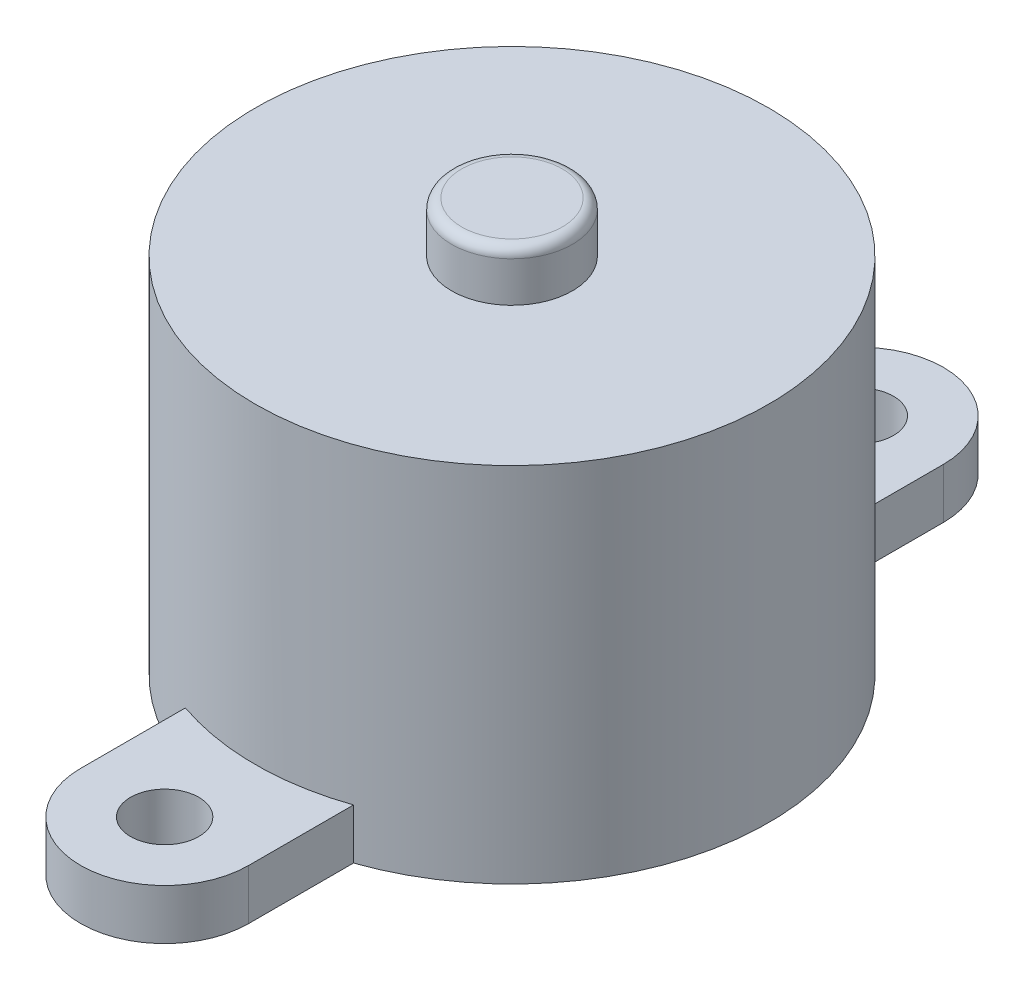
ISO-10303-21;
HEADER;
FILE_DESCRIPTION(('STEP AP214'),'2;1');
FILE_NAME('part.step','',(''),(''),'','','');
FILE_SCHEMA(('AUTOMOTIVE_DESIGN { 1 0 10303 214 1 1 1 1 }'));
ENDSEC;
DATA;
#1=APPLICATION_CONTEXT('core data for automotive mechanical design processes');
#2=APPLICATION_PROTOCOL_DEFINITION('international standard','automotive_design',2000,#1);
#3=PRODUCT_CONTEXT('',#1,'mechanical');
#4=PRODUCT('Part','Part','',(#3));
#5=PRODUCT_RELATED_PRODUCT_CATEGORY('part','',(#4));
#6=PRODUCT_DEFINITION_FORMATION('','',#4);
#7=PRODUCT_DEFINITION_CONTEXT('part definition',#1,'design');
#8=PRODUCT_DEFINITION('design','',#6,#7);
#9=PRODUCT_DEFINITION_SHAPE('','',#8);
#10=(LENGTH_UNIT() NAMED_UNIT(*) SI_UNIT(.MILLI.,.METRE.));
#11=(NAMED_UNIT(*) PLANE_ANGLE_UNIT() SI_UNIT($,.RADIAN.));
#12=(NAMED_UNIT(*) SI_UNIT($,.STERADIAN.) SOLID_ANGLE_UNIT());
#13=UNCERTAINTY_MEASURE_WITH_UNIT(LENGTH_MEASURE(1.E-05),#10,'distance_accuracy_value','');
#14=(GEOMETRIC_REPRESENTATION_CONTEXT(3) GLOBAL_UNCERTAINTY_ASSIGNED_CONTEXT((#13)) GLOBAL_UNIT_ASSIGNED_CONTEXT((#10,
#11,#12)) REPRESENTATION_CONTEXT('',''));
#15=CARTESIAN_POINT('',(0.,0.,0.));
#16=DIRECTION('',(0.,0.,1.));
#17=DIRECTION('',(1.,0.,0.));
#18=AXIS2_PLACEMENT_3D('',#15,#16,#17);
#19=CARTESIAN_POINT('',(0.,18.,0.));
#20=DIRECTION('',(0.,-1.,0.));
#21=DIRECTION('',(0.,0.,-1.));
#22=AXIS2_PLACEMENT_3D('',#19,#20,#21);
#23=CYLINDRICAL_SURFACE('',#22,12.75);
#24=CARTESIAN_POINT('',(0.,0.,0.));
#25=DIRECTION('',(0.,1.,0.));
#26=DIRECTION('',(0.,0.,1.));
#27=AXIS2_PLACEMENT_3D('',#24,#25,#26);
#28=CIRCLE('',#27,12.75);
#29=CARTESIAN_POINT('',(-4.175,0.,-12.047069145647));
#30=VERTEX_POINT('',#29);
#31=CARTESIAN_POINT('',(-4.175,0.,12.047069145647));
#32=VERTEX_POINT('',#31);
#33=EDGE_CURVE('E170',#30,#32,#28,.T.);
#34=ORIENTED_EDGE('',*,*,#33,.T.);
#35=DIRECTION('',(0.,-1.,0.));
#36=VECTOR('',#35,1.);
#37=CARTESIAN_POINT('',(-4.175,2.5,12.047069145647));
#38=LINE('',#37,#36);
#39=CARTESIAN_POINT('',(-4.175,2.5,12.047069145647));
#40=VERTEX_POINT('',#39);
#41=EDGE_CURVE('E48',#40,#32,#38,.T.);
#42=ORIENTED_EDGE('',*,*,#41,.F.);
#43=CARTESIAN_POINT('',(0.,2.5,0.));
#44=DIRECTION('',(0.,-1.,0.));
#45=DIRECTION('',(0.,0.,-1.));
#46=AXIS2_PLACEMENT_3D('',#43,#44,#45);
#47=CIRCLE('',#46,12.75);
#48=CARTESIAN_POINT('',(4.175,2.5,12.047069145647));
#49=VERTEX_POINT('',#48);
#50=EDGE_CURVE('E11',#49,#40,#47,.T.);
#51=ORIENTED_EDGE('',*,*,#50,.F.);
#52=DIRECTION('',(0.,-1.,0.));
#53=VECTOR('',#52,1.);
#54=CARTESIAN_POINT('',(4.175,2.5,12.047069145647));
#55=LINE('',#54,#53);
#56=CARTESIAN_POINT('',(4.175,0.,12.047069145647));
#57=VERTEX_POINT('',#56);
#58=EDGE_CURVE('E118',#49,#57,#55,.T.);
#59=ORIENTED_EDGE('',*,*,#58,.T.);
#60=CARTESIAN_POINT('',(4.175,0.,-12.047069145647));
#61=VERTEX_POINT('',#60);
#62=EDGE_CURVE('E165',#57,#61,#28,.T.);
#63=ORIENTED_EDGE('',*,*,#62,.T.);
#64=DIRECTION('',(0.,-1.,0.));
#65=VECTOR('',#64,1.);
#66=CARTESIAN_POINT('',(4.175,2.5,-12.047069145647));
#67=LINE('',#66,#65);
#68=CARTESIAN_POINT('',(4.175,2.5,-12.047069145647));
#69=VERTEX_POINT('',#68);
#70=EDGE_CURVE('E159',#69,#61,#67,.T.);
#71=ORIENTED_EDGE('',*,*,#70,.F.);
#72=CARTESIAN_POINT('',(0.,2.5,0.));
#73=DIRECTION('',(0.,-1.,0.));
#74=DIRECTION('',(0.,0.,-1.));
#75=AXIS2_PLACEMENT_3D('',#72,#73,#74);
#76=CIRCLE('',#75,12.75);
#77=CARTESIAN_POINT('',(-4.175,2.5,-12.047069145647));
#78=VERTEX_POINT('',#77);
#79=EDGE_CURVE('E41',#78,#69,#76,.T.);
#80=ORIENTED_EDGE('',*,*,#79,.F.);
#81=DIRECTION('',(0.,-1.,0.));
#82=VECTOR('',#81,1.);
#83=CARTESIAN_POINT('',(-4.175,2.5,-12.047069145647));
#84=LINE('',#83,#82);
#85=EDGE_CURVE('E146',#78,#30,#84,.T.);
#86=ORIENTED_EDGE('',*,*,#85,.T.);
#87=EDGE_LOOP('',(#34,#42,#51,#59,#63,#71,#80,#86));
#88=FACE_BOUND('',#87,.T.);
#89=CARTESIAN_POINT('',(0.,18.,0.));
#90=DIRECTION('',(0.,1.,0.));
#91=DIRECTION('',(0.,0.,1.));
#92=AXIS2_PLACEMENT_3D('',#89,#90,#91);
#93=CIRCLE('',#92,12.75);
#94=CARTESIAN_POINT('',(0.,18.,12.75));
#95=VERTEX_POINT('',#94);
#96=EDGE_CURVE('E166',#95,#95,#93,.T.);
#97=ORIENTED_EDGE('',*,*,#96,.F.);
#98=EDGE_LOOP('',(#97));
#99=FACE_BOUND('',#98,.T.);
#100=ADVANCED_FACE('F33',(#88,#99),#23,.T.);
#101=CARTESIAN_POINT('',(0.,18.,0.));
#102=DIRECTION('',(0.,1.,0.));
#103=DIRECTION('',(0.,0.,1.));
#104=AXIS2_PLACEMENT_3D('',#101,#102,#103);
#105=PLANE('',#104);
#106=ORIENTED_EDGE('',*,*,#96,.T.);
#107=EDGE_LOOP('',(#106));
#108=FACE_BOUND('',#107,.T.);
#109=CARTESIAN_POINT('',(0.,18.,0.));
#110=DIRECTION('',(0.,1.,0.));
#111=DIRECTION('',(0.,0.,1.));
#112=AXIS2_PLACEMENT_3D('',#109,#110,#111);
#113=CIRCLE('',#112,3.);
#114=CARTESIAN_POINT('',(0.,18.,3.));
#115=VERTEX_POINT('',#114);
#116=EDGE_CURVE('E162',#115,#115,#113,.T.);
#117=ORIENTED_EDGE('',*,*,#116,.F.);
#118=EDGE_LOOP('',(#117));
#119=FACE_BOUND('',#118,.T.);
#120=ADVANCED_FACE('F214',(#108,#119),#105,.T.);
#121=CARTESIAN_POINT('',(0.,0.,0.));
#122=DIRECTION('',(0.,1.,0.));
#123=DIRECTION('',(0.,0.,1.));
#124=AXIS2_PLACEMENT_3D('',#121,#122,#123);
#125=PLANE('',#124);
#126=ORIENTED_EDGE('',*,*,#62,.F.);
#127=DIRECTION('',(0.,0.,1.));
#128=VECTOR('',#127,1.);
#129=CARTESIAN_POINT('',(4.175,0.,12.047069145647));
#130=LINE('',#129,#128);
#131=CARTESIAN_POINT('',(4.175,0.,17.2523756337526));
#132=VERTEX_POINT('',#131);
#133=EDGE_CURVE('E113',#57,#132,#130,.T.);
#134=ORIENTED_EDGE('',*,*,#133,.T.);
#135=CARTESIAN_POINT('',(0.,0.,17.2523756337526));
#136=DIRECTION('',(0.,-1.,0.));
#137=DIRECTION('',(0.,0.,1.));
#138=AXIS2_PLACEMENT_3D('',#135,#136,#137);
#139=CIRCLE('',#138,4.175);
#140=CARTESIAN_POINT('',(-4.175,0.,17.2523756337526));
#141=VERTEX_POINT('',#140);
#142=EDGE_CURVE('E123',#132,#141,#139,.T.);
#143=ORIENTED_EDGE('',*,*,#142,.T.);
#144=DIRECTION('',(0.,0.,-1.));
#145=VECTOR('',#144,1.);
#146=CARTESIAN_POINT('',(-4.175,0.,12.047069145647));
#147=LINE('',#146,#145);
#148=EDGE_CURVE('E100',#141,#32,#147,.T.);
#149=ORIENTED_EDGE('',*,*,#148,.T.);
#150=ORIENTED_EDGE('',*,*,#33,.F.);
#151=DIRECTION('',(0.,0.,1.));
#152=VECTOR('',#151,1.);
#153=CARTESIAN_POINT('',(-4.175,0.,-12.047069145647));
#154=LINE('',#153,#152);
#155=CARTESIAN_POINT('',(-4.175,0.,-17.2523756337526));
#156=VERTEX_POINT('',#155);
#157=EDGE_CURVE('E141',#156,#30,#154,.T.);
#158=ORIENTED_EDGE('',*,*,#157,.F.);
#159=CARTESIAN_POINT('',(0.,0.,-17.2523756337526));
#160=DIRECTION('',(0.,1.,0.));
#161=DIRECTION('',(0.,0.,-1.));
#162=AXIS2_PLACEMENT_3D('',#159,#160,#161);
#163=CIRCLE('',#162,4.175);
#164=CARTESIAN_POINT('',(4.175,0.,-17.2523756337526));
#165=VERTEX_POINT('',#164);
#166=EDGE_CURVE('E148',#165,#156,#163,.T.);
#167=ORIENTED_EDGE('',*,*,#166,.F.);
#168=DIRECTION('',(0.,0.,-1.));
#169=VECTOR('',#168,1.);
#170=CARTESIAN_POINT('',(4.175,0.,-12.047069145647));
#171=LINE('',#170,#169);
#172=EDGE_CURVE('E135',#61,#165,#171,.T.);
#173=ORIENTED_EDGE('',*,*,#172,.F.);
#174=EDGE_LOOP('',(#126,#134,#143,#149,#150,#158,#167,#173));
#175=FACE_BOUND('',#174,.T.);
#176=CARTESIAN_POINT('',(0.,0.,-17.2523756337526));
#177=DIRECTION('',(0.,1.,0.));
#178=DIRECTION('',(0.,0.,1.));
#179=AXIS2_PLACEMENT_3D('',#176,#177,#178);
#180=CIRCLE('',#179,1.69339007976192);
#181=CARTESIAN_POINT('',(0.,0.,-15.5589855539907));
#182=VERTEX_POINT('',#181);
#183=EDGE_CURVE('E131',#182,#182,#180,.T.);
#184=ORIENTED_EDGE('',*,*,#183,.T.);
#185=EDGE_LOOP('',(#184));
#186=FACE_BOUND('',#185,.T.);
#187=CARTESIAN_POINT('',(0.,0.,17.2523756337526));
#188=DIRECTION('',(0.,-1.,0.));
#189=DIRECTION('',(0.,0.,-1.));
#190=AXIS2_PLACEMENT_3D('',#187,#188,#189);
#191=CIRCLE('',#190,1.69339007976192);
#192=CARTESIAN_POINT('',(0.,0.,15.5589855539907));
#193=VERTEX_POINT('',#192);
#194=EDGE_CURVE('E253',#193,#193,#191,.T.);
#195=ORIENTED_EDGE('',*,*,#194,.F.);
#196=EDGE_LOOP('',(#195));
#197=FACE_BOUND('',#196,.T.);
#198=ADVANCED_FACE('F197',(#175,#186,#197),#125,.F.);
#199=CARTESIAN_POINT('',(0.,20.5,0.));
#200=DIRECTION('',(0.,-1.,0.));
#201=DIRECTION('',(0.,0.,-1.));
#202=AXIS2_PLACEMENT_3D('',#199,#200,#201);
#203=CYLINDRICAL_SURFACE('',#202,3.);
#204=CARTESIAN_POINT('',(0.,20.,0.));
#205=DIRECTION('',(0.,1.,0.));
#206=DIRECTION('',(0.,0.,1.));
#207=AXIS2_PLACEMENT_3D('',#204,#205,#206);
#208=CIRCLE('',#207,3.);
#209=CARTESIAN_POINT('',(0.,20.,3.));
#210=VERTEX_POINT('',#209);
#211=EDGE_CURVE('E174',#210,#210,#208,.F.);
#212=ORIENTED_EDGE('',*,*,#211,.T.);
#213=EDGE_LOOP('',(#212));
#214=FACE_BOUND('',#213,.T.);
#215=ORIENTED_EDGE('',*,*,#116,.T.);
#216=EDGE_LOOP('',(#215));
#217=FACE_BOUND('',#216,.T.);
#218=ADVANCED_FACE('F222',(#214,#217),#203,.T.);
#219=CARTESIAN_POINT('',(0.,20.5,0.));
#220=DIRECTION('',(0.,1.,0.));
#221=DIRECTION('',(0.,0.,1.));
#222=AXIS2_PLACEMENT_3D('',#219,#220,#221);
#223=PLANE('',#222);
#224=CARTESIAN_POINT('',(0.,20.5,0.));
#225=DIRECTION('',(0.,1.,0.));
#226=DIRECTION('',(0.,0.,1.));
#227=AXIS2_PLACEMENT_3D('',#224,#225,#226);
#228=CIRCLE('',#227,2.5);
#229=CARTESIAN_POINT('',(0.,20.5,2.5));
#230=VERTEX_POINT('',#229);
#231=EDGE_CURVE('E169',#230,#230,#228,.T.);
#232=ORIENTED_EDGE('',*,*,#231,.T.);
#233=EDGE_LOOP('',(#232));
#234=FACE_BOUND('',#233,.T.);
#235=ADVANCED_FACE('F226',(#234),#223,.T.);
#236=CARTESIAN_POINT('',(0.,20.,0.));
#237=DIRECTION('',(0.,1.,0.));
#238=DIRECTION('',(0.,0.,1.));
#239=AXIS2_PLACEMENT_3D('',#236,#237,#238);
#240=TOROIDAL_SURFACE('',#239,2.5,0.5);
#241=ORIENTED_EDGE('',*,*,#211,.F.);
#242=EDGE_LOOP('',(#241));
#243=FACE_BOUND('',#242,.T.);
#244=ORIENTED_EDGE('',*,*,#231,.F.);
#245=EDGE_LOOP('',(#244));
#246=FACE_BOUND('',#245,.T.);
#247=ADVANCED_FACE('F35',(#243,#246),#240,.T.);
#248=CARTESIAN_POINT('',(0.,2.5,-17.2523756337526));
#249=DIRECTION('',(0.,-1.,0.));
#250=DIRECTION('',(0.,0.,-1.));
#251=AXIS2_PLACEMENT_3D('',#248,#249,#250);
#252=PLANE('',#251);
#253=CARTESIAN_POINT('',(0.,2.5,-17.2523756337526));
#254=DIRECTION('',(0.,1.,0.));
#255=DIRECTION('',(0.,0.,1.));
#256=AXIS2_PLACEMENT_3D('',#253,#254,#255);
#257=CIRCLE('',#256,1.69339007976192);
#258=CARTESIAN_POINT('',(0.,2.5,-15.5589855539907));
#259=VERTEX_POINT('',#258);
#260=EDGE_CURVE('E132',#259,#259,#257,.T.);
#261=ORIENTED_EDGE('',*,*,#260,.F.);
#262=EDGE_LOOP('',(#261));
#263=FACE_BOUND('',#262,.T.);
#264=DIRECTION('',(0.,0.,1.));
#265=VECTOR('',#264,1.);
#266=CARTESIAN_POINT('',(-4.175,2.5,-12.047069145647));
#267=LINE('',#266,#265);
#268=CARTESIAN_POINT('',(-4.175,2.5,-17.2523756337526));
#269=VERTEX_POINT('',#268);
#270=EDGE_CURVE('E143',#269,#78,#267,.T.);
#271=ORIENTED_EDGE('',*,*,#270,.T.);
#272=ORIENTED_EDGE('',*,*,#79,.T.);
#273=DIRECTION('',(0.,0.,-1.));
#274=VECTOR('',#273,1.);
#275=CARTESIAN_POINT('',(4.175,2.5,-12.047069145647));
#276=LINE('',#275,#274);
#277=CARTESIAN_POINT('',(4.175,2.5,-17.2523756337526));
#278=VERTEX_POINT('',#277);
#279=EDGE_CURVE('E138',#69,#278,#276,.T.);
#280=ORIENTED_EDGE('',*,*,#279,.T.);
#281=CARTESIAN_POINT('',(0.,2.5,-17.2523756337526));
#282=DIRECTION('',(0.,1.,0.));
#283=DIRECTION('',(0.,0.,-1.));
#284=AXIS2_PLACEMENT_3D('',#281,#282,#283);
#285=CIRCLE('',#284,4.175);
#286=EDGE_CURVE('E140',#278,#269,#285,.T.);
#287=ORIENTED_EDGE('',*,*,#286,.T.);
#288=EDGE_LOOP('',(#271,#272,#280,#287));
#289=FACE_BOUND('',#288,.T.);
#290=ADVANCED_FACE('F179',(#263,#289),#252,.F.);
#291=CARTESIAN_POINT('',(4.175,2.5,-12.047069145647));
#292=DIRECTION('',(-1.,0.,0.));
#293=DIRECTION('',(0.,0.,1.));
#294=AXIS2_PLACEMENT_3D('',#291,#292,#293);
#295=PLANE('',#294);
#296=ORIENTED_EDGE('',*,*,#172,.T.);
#297=DIRECTION('',(0.,-1.,0.));
#298=VECTOR('',#297,1.);
#299=CARTESIAN_POINT('',(4.175,2.5,-17.2523756337526));
#300=LINE('',#299,#298);
#301=EDGE_CURVE('E156',#278,#165,#300,.T.);
#302=ORIENTED_EDGE('',*,*,#301,.F.);
#303=ORIENTED_EDGE('',*,*,#279,.F.);
#304=ORIENTED_EDGE('',*,*,#70,.T.);
#305=EDGE_LOOP('',(#296,#302,#303,#304));
#306=FACE_BOUND('',#305,.T.);
#307=ADVANCED_FACE('F184',(#306),#295,.F.);
#308=CARTESIAN_POINT('',(0.,2.5,-17.2523756337526));
#309=DIRECTION('',(0.,-1.,0.));
#310=DIRECTION('',(0.,0.,-1.));
#311=AXIS2_PLACEMENT_3D('',#308,#309,#310);
#312=CYLINDRICAL_SURFACE('',#311,4.175);
#313=ORIENTED_EDGE('',*,*,#166,.T.);
#314=DIRECTION('',(0.,-1.,0.));
#315=VECTOR('',#314,1.);
#316=CARTESIAN_POINT('',(-4.175,2.5,-17.2523756337526));
#317=LINE('',#316,#315);
#318=EDGE_CURVE('E153',#269,#156,#317,.T.);
#319=ORIENTED_EDGE('',*,*,#318,.F.);
#320=ORIENTED_EDGE('',*,*,#286,.F.);
#321=ORIENTED_EDGE('',*,*,#301,.T.);
#322=EDGE_LOOP('',(#313,#319,#320,#321));
#323=FACE_BOUND('',#322,.T.);
#324=ADVANCED_FACE('F190',(#323),#312,.T.);
#325=CARTESIAN_POINT('',(-4.175,2.5,-12.047069145647));
#326=DIRECTION('',(1.,0.,0.));
#327=DIRECTION('',(0.,0.,-1.));
#328=AXIS2_PLACEMENT_3D('',#325,#326,#327);
#329=PLANE('',#328);
#330=ORIENTED_EDGE('',*,*,#157,.T.);
#331=ORIENTED_EDGE('',*,*,#85,.F.);
#332=ORIENTED_EDGE('',*,*,#270,.F.);
#333=ORIENTED_EDGE('',*,*,#318,.T.);
#334=EDGE_LOOP('',(#330,#331,#332,#333));
#335=FACE_BOUND('',#334,.T.);
#336=ADVANCED_FACE('F193',(#335),#329,.F.);
#337=CARTESIAN_POINT('',(0.,2.5,-17.2523756337526));
#338=DIRECTION('',(0.,-1.,0.));
#339=DIRECTION('',(0.,0.,-1.));
#340=AXIS2_PLACEMENT_3D('',#337,#338,#339);
#341=CYLINDRICAL_SURFACE('',#340,1.69339007976192);
#342=ORIENTED_EDGE('',*,*,#260,.T.);
#343=EDGE_LOOP('',(#342));
#344=FACE_BOUND('',#343,.T.);
#345=ORIENTED_EDGE('',*,*,#183,.F.);
#346=EDGE_LOOP('',(#345));
#347=FACE_BOUND('',#346,.T.);
#348=ADVANCED_FACE('F237',(#344,#347),#341,.F.);
#349=CARTESIAN_POINT('',(0.,2.5,17.2523756337526));
#350=DIRECTION('',(0.,-1.,0.));
#351=DIRECTION('',(0.,0.,1.));
#352=AXIS2_PLACEMENT_3D('',#349,#350,#351);
#353=PLANE('',#352);
#354=CARTESIAN_POINT('',(0.,2.5,17.2523756337526));
#355=DIRECTION('',(0.,-1.,0.));
#356=DIRECTION('',(0.,0.,-1.));
#357=AXIS2_PLACEMENT_3D('',#354,#355,#356);
#358=CIRCLE('',#357,1.69339007976192);
#359=CARTESIAN_POINT('',(0.,2.5,15.5589855539907));
#360=VERTEX_POINT('',#359);
#361=EDGE_CURVE('E124',#360,#360,#358,.T.);
#362=ORIENTED_EDGE('',*,*,#361,.T.);
#363=EDGE_LOOP('',(#362));
#364=FACE_BOUND('',#363,.T.);
#365=DIRECTION('',(0.,0.,1.));
#366=VECTOR('',#365,1.);
#367=CARTESIAN_POINT('',(4.175,2.5,12.047069145647));
#368=LINE('',#367,#366);
#369=CARTESIAN_POINT('',(4.175,2.5,17.2523756337526));
#370=VERTEX_POINT('',#369);
#371=EDGE_CURVE('E116',#49,#370,#368,.T.);
#372=ORIENTED_EDGE('',*,*,#371,.F.);
#373=ORIENTED_EDGE('',*,*,#50,.T.);
#374=DIRECTION('',(0.,0.,-1.));
#375=VECTOR('',#374,1.);
#376=CARTESIAN_POINT('',(-4.175,2.5,12.047069145647));
#377=LINE('',#376,#375);
#378=CARTESIAN_POINT('',(-4.175,2.5,17.2523756337526));
#379=VERTEX_POINT('',#378);
#380=EDGE_CURVE('E98',#379,#40,#377,.T.);
#381=ORIENTED_EDGE('',*,*,#380,.F.);
#382=CARTESIAN_POINT('',(0.,2.5,17.2523756337526));
#383=DIRECTION('',(0.,-1.,0.));
#384=DIRECTION('',(0.,0.,1.));
#385=AXIS2_PLACEMENT_3D('',#382,#383,#384);
#386=CIRCLE('',#385,4.175);
#387=EDGE_CURVE('E111',#370,#379,#386,.T.);
#388=ORIENTED_EDGE('',*,*,#387,.F.);
#389=EDGE_LOOP('',(#372,#373,#381,#388));
#390=FACE_BOUND('',#389,.T.);
#391=ADVANCED_FACE('F110',(#364,#390),#353,.F.);
#392=CARTESIAN_POINT('',(-4.175,2.5,12.047069145647));
#393=DIRECTION('',(-1.,0.,0.));
#394=DIRECTION('',(0.,0.,1.));
#395=AXIS2_PLACEMENT_3D('',#392,#393,#394);
#396=PLANE('',#395);
#397=ORIENTED_EDGE('',*,*,#148,.F.);
#398=DIRECTION('',(0.,-1.,0.));
#399=VECTOR('',#398,1.);
#400=CARTESIAN_POINT('',(-4.175,2.5,17.2523756337526));
#401=LINE('',#400,#399);
#402=EDGE_CURVE('E95',#379,#141,#401,.T.);
#403=ORIENTED_EDGE('',*,*,#402,.F.);
#404=ORIENTED_EDGE('',*,*,#380,.T.);
#405=ORIENTED_EDGE('',*,*,#41,.T.);
#406=EDGE_LOOP('',(#397,#403,#404,#405));
#407=FACE_BOUND('',#406,.T.);
#408=ADVANCED_FACE('F97',(#407),#396,.T.);
#409=CARTESIAN_POINT('',(0.,2.5,17.2523756337526));
#410=DIRECTION('',(0.,-1.,0.));
#411=DIRECTION('',(0.,0.,-1.));
#412=AXIS2_PLACEMENT_3D('',#409,#410,#411);
#413=CYLINDRICAL_SURFACE('',#412,4.175);
#414=ORIENTED_EDGE('',*,*,#142,.F.);
#415=DIRECTION('',(0.,-1.,0.));
#416=VECTOR('',#415,1.);
#417=CARTESIAN_POINT('',(4.175,2.5,17.2523756337526));
#418=LINE('',#417,#416);
#419=EDGE_CURVE('E105',#370,#132,#418,.T.);
#420=ORIENTED_EDGE('',*,*,#419,.F.);
#421=ORIENTED_EDGE('',*,*,#387,.T.);
#422=ORIENTED_EDGE('',*,*,#402,.T.);
#423=EDGE_LOOP('',(#414,#420,#421,#422));
#424=FACE_BOUND('',#423,.T.);
#425=ADVANCED_FACE('F115',(#424),#413,.T.);
#426=CARTESIAN_POINT('',(4.175,2.5,12.047069145647));
#427=DIRECTION('',(1.,0.,0.));
#428=DIRECTION('',(0.,0.,-1.));
#429=AXIS2_PLACEMENT_3D('',#426,#427,#428);
#430=PLANE('',#429);
#431=ORIENTED_EDGE('',*,*,#133,.F.);
#432=ORIENTED_EDGE('',*,*,#58,.F.);
#433=ORIENTED_EDGE('',*,*,#371,.T.);
#434=ORIENTED_EDGE('',*,*,#419,.T.);
#435=EDGE_LOOP('',(#431,#432,#433,#434));
#436=FACE_BOUND('',#435,.T.);
#437=ADVANCED_FACE('F201',(#436),#430,.T.);
#438=CARTESIAN_POINT('',(0.,2.5,17.2523756337526));
#439=DIRECTION('',(0.,-1.,0.));
#440=DIRECTION('',(0.,0.,-1.));
#441=AXIS2_PLACEMENT_3D('',#438,#439,#440);
#442=CYLINDRICAL_SURFACE('',#441,1.69339007976192);
#443=ORIENTED_EDGE('',*,*,#361,.F.);
#444=EDGE_LOOP('',(#443));
#445=FACE_BOUND('',#444,.T.);
#446=ORIENTED_EDGE('',*,*,#194,.T.);
#447=EDGE_LOOP('',(#446));
#448=FACE_BOUND('',#447,.T.);
#449=ADVANCED_FACE('F203',(#445,#448),#442,.F.);
#450=CLOSED_SHELL('',(#100,#120,#198,#218,#235,#247,#290,#307,#324,#336,#348,#391,#408,#425,
#437,#449));
#451=MANIFOLD_SOLID_BREP('B2',#450);
#452=ADVANCED_BREP_SHAPE_REPRESENTATION('',(#18,#451),#14);
#453=SHAPE_DEFINITION_REPRESENTATION(#9,#452);
ENDSEC;
END-ISO-10303-21;
